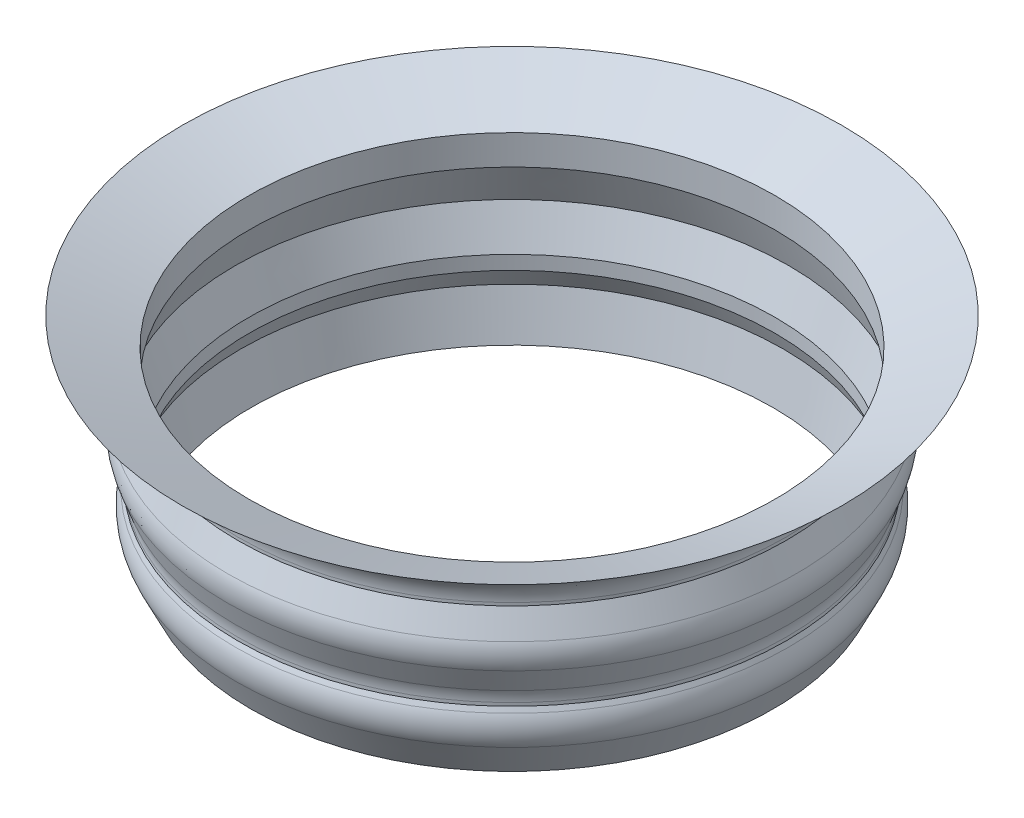
ISO-10303-21;
HEADER;
FILE_DESCRIPTION(('STEP AP214'),'2;1');
FILE_NAME('part.step','',(''),(''),'','','');
FILE_SCHEMA(('AUTOMOTIVE_DESIGN { 1 0 10303 214 1 1 1 1 }'));
ENDSEC;
DATA;
#1=APPLICATION_CONTEXT('core data for automotive mechanical design processes');
#2=APPLICATION_PROTOCOL_DEFINITION('international standard','automotive_design',2000,#1);
#3=PRODUCT_CONTEXT('',#1,'mechanical');
#4=PRODUCT('Part','Part','',(#3));
#5=PRODUCT_RELATED_PRODUCT_CATEGORY('part','',(#4));
#6=PRODUCT_DEFINITION_FORMATION('','',#4);
#7=PRODUCT_DEFINITION_CONTEXT('part definition',#1,'design');
#8=PRODUCT_DEFINITION('design','',#6,#7);
#9=PRODUCT_DEFINITION_SHAPE('','',#8);
#10=(LENGTH_UNIT() NAMED_UNIT(*) SI_UNIT(.MILLI.,.METRE.));
#11=(NAMED_UNIT(*) PLANE_ANGLE_UNIT() SI_UNIT($,.RADIAN.));
#12=(NAMED_UNIT(*) SI_UNIT($,.STERADIAN.) SOLID_ANGLE_UNIT());
#13=UNCERTAINTY_MEASURE_WITH_UNIT(LENGTH_MEASURE(1.E-05),#10,'distance_accuracy_value','');
#14=(GEOMETRIC_REPRESENTATION_CONTEXT(3) GLOBAL_UNCERTAINTY_ASSIGNED_CONTEXT((#13)) GLOBAL_UNIT_ASSIGNED_CONTEXT((#10,
#11,#12)) REPRESENTATION_CONTEXT('',''));
#15=CARTESIAN_POINT('',(0.,0.,0.));
#16=DIRECTION('',(0.,0.,1.));
#17=DIRECTION('',(1.,0.,0.));
#18=AXIS2_PLACEMENT_3D('',#15,#16,#17);
#19=CARTESIAN_POINT('',(0.,72.7332814744845,0.));
#20=DIRECTION('',(0.,1.,0.));
#21=DIRECTION('',(0.,0.,1.));
#22=AXIS2_PLACEMENT_3D('',#19,#20,#21);
#23=CONICAL_SURFACE('',#22,73.025,0.996140422147718);
#24=CARTESIAN_POINT('',(0.,67.0741380629393,0.));
#25=DIRECTION('',(0.,1.,0.));
#26=DIRECTION('',(0.,0.,1.));
#27=AXIS2_PLACEMENT_3D('',#24,#25,#26);
#28=CIRCLE('',#27,64.2857795080226);
#29=CARTESIAN_POINT('',(0.,67.0741380629393,64.2857795080226));
#30=VERTEX_POINT('',#29);
#31=EDGE_CURVE('E48',#30,#30,#28,.T.);
#32=ORIENTED_EDGE('',*,*,#31,.T.);
#33=EDGE_LOOP('',(#32));
#34=FACE_BOUND('',#33,.T.);
#35=CARTESIAN_POINT('',(0.,72.7332814744845,0.));
#36=DIRECTION('',(0.,-1.,0.));
#37=DIRECTION('',(0.,0.,-1.));
#38=AXIS2_PLACEMENT_3D('',#35,#36,#37);
#39=CIRCLE('',#38,73.025);
#40=CARTESIAN_POINT('',(0.,72.7332814744845,-73.025));
#41=VERTEX_POINT('',#40);
#42=EDGE_CURVE('E65',#41,#41,#39,.T.);
#43=ORIENTED_EDGE('',*,*,#42,.T.);
#44=EDGE_LOOP('',(#43));
#45=FACE_BOUND('',#44,.T.);
#46=ADVANCED_FACE('F33',(#34,#45),#23,.T.);
#47=CARTESIAN_POINT('',(0.,66.6316844672459,0.));
#48=DIRECTION('',(0.,1.,0.));
#49=DIRECTION('',(0.,0.,1.));
#50=AXIS2_PLACEMENT_3D('',#47,#48,#49);
#51=CONICAL_SURFACE('',#50,58.2676,1.17874048306246);
#52=ORIENTED_EDGE('',*,*,#42,.F.);
#53=EDGE_LOOP('',(#52));
#54=FACE_BOUND('',#53,.T.);
#55=CARTESIAN_POINT('',(0.,66.6316844672459,0.));
#56=DIRECTION('',(0.,-1.,0.));
#57=DIRECTION('',(0.,0.,-1.));
#58=AXIS2_PLACEMENT_3D('',#55,#56,#57);
#59=CIRCLE('',#58,58.2676);
#60=CARTESIAN_POINT('',(0.,66.6316844672459,-58.2676));
#61=VERTEX_POINT('',#60);
#62=EDGE_CURVE('E68',#61,#61,#59,.T.);
#63=ORIENTED_EDGE('',*,*,#62,.T.);
#64=EDGE_LOOP('',(#63));
#65=FACE_BOUND('',#64,.T.);
#66=ADVANCED_FACE('F113',(#54,#65),#51,.F.);
#67=CARTESIAN_POINT('',(0.,0.,0.));
#68=DIRECTION('',(0.,-1.,0.));
#69=DIRECTION('',(0.,0.,-1.));
#70=AXIS2_PLACEMENT_3D('',#67,#68,#69);
#71=CYLINDRICAL_SURFACE('',#70,58.2676);
#72=ORIENTED_EDGE('',*,*,#62,.F.);
#73=EDGE_LOOP('',(#72));
#74=FACE_BOUND('',#73,.T.);
#75=CARTESIAN_POINT('',(0.,60.0255926489821,0.));
#76=DIRECTION('',(0.,-1.,0.));
#77=DIRECTION('',(0.,0.,-1.));
#78=AXIS2_PLACEMENT_3D('',#75,#76,#77);
#79=CIRCLE('',#78,58.2676);
#80=CARTESIAN_POINT('',(0.,60.0255926489821,-58.2676));
#81=VERTEX_POINT('',#80);
#82=EDGE_CURVE('E71',#81,#81,#79,.T.);
#83=ORIENTED_EDGE('',*,*,#82,.T.);
#84=EDGE_LOOP('',(#83));
#85=FACE_BOUND('',#84,.T.);
#86=ADVANCED_FACE('F119',(#74,#85),#71,.F.);
#87=CARTESIAN_POINT('',(0.,51.6512814744845,0.));
#88=DIRECTION('',(0.,-1.,0.));
#89=DIRECTION('',(0.,0.,-1.));
#90=AXIS2_PLACEMENT_3D('',#87,#88,#89);
#91=CONICAL_SURFACE('',#90,61.3156,0.349065850398867);
#92=ORIENTED_EDGE('',*,*,#82,.F.);
#93=EDGE_LOOP('',(#92));
#94=FACE_BOUND('',#93,.T.);
#95=CARTESIAN_POINT('',(0.,51.6512814744845,0.));
#96=DIRECTION('',(0.,-1.,0.));
#97=DIRECTION('',(0.,0.,-1.));
#98=AXIS2_PLACEMENT_3D('',#95,#96,#97);
#99=CIRCLE('',#98,61.3156);
#100=CARTESIAN_POINT('',(0.,51.6512814744845,-61.3156));
#101=VERTEX_POINT('',#100);
#102=EDGE_CURVE('E74',#101,#101,#99,.T.);
#103=ORIENTED_EDGE('',*,*,#102,.T.);
#104=EDGE_LOOP('',(#103));
#105=FACE_BOUND('',#104,.T.);
#106=ADVANCED_FACE('F164',(#94,#105),#91,.F.);
#107=CARTESIAN_POINT('',(0.,43.2769702999868,0.));
#108=DIRECTION('',(0.,1.,0.));
#109=DIRECTION('',(0.,0.,1.));
#110=AXIS2_PLACEMENT_3D('',#107,#108,#109);
#111=CONICAL_SURFACE('',#110,58.2676,0.349065850398866);
#112=ORIENTED_EDGE('',*,*,#102,.F.);
#113=EDGE_LOOP('',(#112));
#114=FACE_BOUND('',#113,.T.);
#115=CARTESIAN_POINT('',(0.,43.2769702999868,0.));
#116=DIRECTION('',(0.,-1.,0.));
#117=DIRECTION('',(0.,0.,-1.));
#118=AXIS2_PLACEMENT_3D('',#115,#116,#117);
#119=CIRCLE('',#118,58.2676);
#120=CARTESIAN_POINT('',(0.,43.2769702999868,-58.2676));
#121=VERTEX_POINT('',#120);
#122=EDGE_CURVE('E77',#121,#121,#119,.T.);
#123=ORIENTED_EDGE('',*,*,#122,.T.);
#124=EDGE_LOOP('',(#123));
#125=FACE_BOUND('',#124,.T.);
#126=ADVANCED_FACE('F160',(#114,#125),#111,.F.);
#127=CARTESIAN_POINT('',(0.,0.,0.));
#128=DIRECTION('',(0.,-1.,0.));
#129=DIRECTION('',(0.,0.,-1.));
#130=AXIS2_PLACEMENT_3D('',#127,#128,#129);
#131=CYLINDRICAL_SURFACE('',#130,58.2676);
#132=ORIENTED_EDGE('',*,*,#122,.F.);
#133=EDGE_LOOP('',(#132));
#134=FACE_BOUND('',#133,.T.);
#135=CARTESIAN_POINT('',(0.,40.2035702999868,0.));
#136=DIRECTION('',(0.,-1.,0.));
#137=DIRECTION('',(0.,0.,-1.));
#138=AXIS2_PLACEMENT_3D('',#135,#136,#137);
#139=CIRCLE('',#138,58.2676);
#140=CARTESIAN_POINT('',(0.,40.2035702999868,-58.2676));
#141=VERTEX_POINT('',#140);
#142=EDGE_CURVE('E80',#141,#141,#139,.T.);
#143=ORIENTED_EDGE('',*,*,#142,.T.);
#144=EDGE_LOOP('',(#143));
#145=FACE_BOUND('',#144,.T.);
#146=ADVANCED_FACE('F152',(#134,#145),#131,.F.);
#147=CARTESIAN_POINT('',(0.,36.2393838368873,0.));
#148=DIRECTION('',(0.,-1.,0.));
#149=DIRECTION('',(0.,0.,-1.));
#150=AXIS2_PLACEMENT_3D('',#147,#148,#149);
#151=CONICAL_SURFACE('',#150,60.1289792599799,0.438991314074099);
#152=ORIENTED_EDGE('',*,*,#142,.F.);
#153=EDGE_LOOP('',(#152));
#154=FACE_BOUND('',#153,.T.);
#155=CARTESIAN_POINT('',(0.,36.2393838368873,0.));
#156=DIRECTION('',(0.,-1.,0.));
#157=DIRECTION('',(0.,0.,-1.));
#158=AXIS2_PLACEMENT_3D('',#155,#156,#157);
#159=CIRCLE('',#158,60.1289792599799);
#160=CARTESIAN_POINT('',(0.,36.2393838368873,-60.1289792599799));
#161=VERTEX_POINT('',#160);
#162=EDGE_CURVE('E83',#161,#161,#159,.T.);
#163=ORIENTED_EDGE('',*,*,#162,.T.);
#164=EDGE_LOOP('',(#163));
#165=FACE_BOUND('',#164,.T.);
#166=ADVANCED_FACE('F146',(#154,#165),#151,.F.);
#167=CARTESIAN_POINT('',(0.,26.163828165302,0.));
#168=DIRECTION('',(0.,1.,0.));
#169=DIRECTION('',(0.,0.,1.));
#170=AXIS2_PLACEMENT_3D('',#167,#168,#169);
#171=CONICAL_SURFACE('',#170,57.8313234477453,0.224208529564345);
#172=ORIENTED_EDGE('',*,*,#162,.F.);
#173=EDGE_LOOP('',(#172));
#174=FACE_BOUND('',#173,.T.);
#175=CARTESIAN_POINT('',(0.,26.163828165302,0.));
#176=DIRECTION('',(0.,-1.,0.));
#177=DIRECTION('',(0.,0.,-1.));
#178=AXIS2_PLACEMENT_3D('',#175,#176,#177);
#179=CIRCLE('',#178,57.8313234477453);
#180=CARTESIAN_POINT('',(0.,26.163828165302,-57.8313234477453));
#181=VERTEX_POINT('',#180);
#182=EDGE_CURVE('E86',#181,#181,#179,.T.);
#183=ORIENTED_EDGE('',*,*,#182,.T.);
#184=EDGE_LOOP('',(#183));
#185=FACE_BOUND('',#184,.T.);
#186=ADVANCED_FACE('F141',(#174,#185),#171,.F.);
#187=CARTESIAN_POINT('',(0.,36.4652582564435,0.));
#188=DIRECTION('',(0.,1.,0.));
#189=DIRECTION('',(0.,0.,1.));
#190=AXIS2_PLACEMENT_3D('',#187,#188,#189);
#191=CONICAL_SURFACE('',#190,62.828989292589,0.451691455621674);
#192=CARTESIAN_POINT('',(0.,33.1928366686193,0.));
#193=DIRECTION('',(0.,-1.,0.));
#194=DIRECTION('',(0.,0.,-1.));
#195=AXIS2_PLACEMENT_3D('',#192,#193,#194);
#196=CIRCLE('',#195,61.2413971374511);
#197=CARTESIAN_POINT('',(0.,33.1928366686193,-61.2413971374511));
#198=VERTEX_POINT('',#197);
#199=EDGE_CURVE('E44',#198,#198,#196,.T.);
#200=ORIENTED_EDGE('',*,*,#199,.T.);
#201=EDGE_LOOP('',(#200));
#202=FACE_BOUND('',#201,.T.);
#203=ORIENTED_EDGE('',*,*,#182,.F.);
#204=EDGE_LOOP('',(#203));
#205=FACE_BOUND('',#204,.T.);
#206=ADVANCED_FACE('F137',(#202,#205),#191,.T.);
#207=CARTESIAN_POINT('',(0.,40.770218692299,0.));
#208=DIRECTION('',(0.,-1.,0.));
#209=DIRECTION('',(0.,0.,-1.));
#210=AXIS2_PLACEMENT_3D('',#207,#208,#209);
#211=CONICAL_SURFACE('',#210,60.8076,0.4389913140741);
#212=CARTESIAN_POINT('',(0.,39.7575780405701,0.));
#213=DIRECTION('',(0.,1.,0.));
#214=DIRECTION('',(0.,0.,1.));
#215=AXIS2_PLACEMENT_3D('',#212,#213,#214);
#216=CIRCLE('',#215,61.2830842700984);
#217=CARTESIAN_POINT('',(0.,39.7575780405701,61.2830842700984));
#218=VERTEX_POINT('',#217);
#219=EDGE_CURVE('E40',#218,#218,#216,.T.);
#220=ORIENTED_EDGE('',*,*,#219,.T.);
#221=EDGE_LOOP('',(#220));
#222=FACE_BOUND('',#221,.T.);
#223=CARTESIAN_POINT('',(0.,40.770218692299,0.));
#224=DIRECTION('',(0.,-1.,0.));
#225=DIRECTION('',(0.,0.,-1.));
#226=AXIS2_PLACEMENT_3D('',#223,#224,#225);
#227=CIRCLE('',#226,60.8076);
#228=CARTESIAN_POINT('',(0.,40.770218692299,-60.8076));
#229=VERTEX_POINT('',#228);
#230=EDGE_CURVE('E89',#229,#229,#227,.T.);
#231=ORIENTED_EDGE('',*,*,#230,.T.);
#232=EDGE_LOOP('',(#231));
#233=FACE_BOUND('',#232,.T.);
#234=ADVANCED_FACE('F140',(#222,#233),#211,.T.);
#235=CARTESIAN_POINT('',(0.,0.,0.));
#236=DIRECTION('',(0.,-1.,0.));
#237=DIRECTION('',(0.,0.,-1.));
#238=AXIS2_PLACEMENT_3D('',#235,#236,#237);
#239=CYLINDRICAL_SURFACE('',#238,60.8076);
#240=CARTESIAN_POINT('',(0.,41.4854881759888,0.));
#241=DIRECTION('',(0.,-1.,0.));
#242=DIRECTION('',(0.,0.,-1.));
#243=AXIS2_PLACEMENT_3D('',#240,#241,#242);
#244=CIRCLE('',#243,60.8076);
#245=CARTESIAN_POINT('',(0.,41.4854881759888,-60.8076));
#246=VERTEX_POINT('',#245);
#247=EDGE_CURVE('E62',#246,#246,#244,.T.);
#248=ORIENTED_EDGE('',*,*,#247,.T.);
#249=EDGE_LOOP('',(#248));
#250=FACE_BOUND('',#249,.T.);
#251=ORIENTED_EDGE('',*,*,#230,.F.);
#252=EDGE_LOOP('',(#251));
#253=FACE_BOUND('',#252,.T.);
#254=ADVANCED_FACE('F225',(#250,#253),#239,.T.);
#255=CARTESIAN_POINT('',(0.,51.9789520060735,0.));
#256=DIRECTION('',(0.,1.,0.));
#257=DIRECTION('',(0.,0.,1.));
#258=AXIS2_PLACEMENT_3D('',#255,#256,#257);
#259=CONICAL_SURFACE('',#258,64.1378738622334,0.349065850398866);
#260=CARTESIAN_POINT('',(0.,44.0916816681304,0.));
#261=DIRECTION('',(0.,1.,0.));
#262=DIRECTION('',(0.,0.,1.));
#263=AXIS2_PLACEMENT_3D('',#260,#261,#262);
#264=CIRCLE('',#263,61.2671422296114);
#265=CARTESIAN_POINT('',(0.,44.0916816681304,61.2671422296114));
#266=VERTEX_POINT('',#265);
#267=EDGE_CURVE('E56',#266,#266,#264,.T.);
#268=ORIENTED_EDGE('',*,*,#267,.T.);
#269=EDGE_LOOP('',(#268));
#270=FACE_BOUND('',#269,.T.);
#271=CARTESIAN_POINT('',(0.,49.1956063387652,0.));
#272=DIRECTION('',(0.,-1.,0.));
#273=DIRECTION('',(0.,0.,-1.));
#274=AXIS2_PLACEMENT_3D('',#271,#272,#273);
#275=CIRCLE('',#274,63.1248188876594);
#276=CARTESIAN_POINT('',(0.,49.1956063387652,-63.1248188876594));
#277=VERTEX_POINT('',#276);
#278=EDGE_CURVE('E59',#277,#277,#275,.T.);
#279=ORIENTED_EDGE('',*,*,#278,.T.);
#280=EDGE_LOOP('',(#279));
#281=FACE_BOUND('',#280,.T.);
#282=ADVANCED_FACE('F110',(#270,#281),#259,.T.);
#283=CARTESIAN_POINT('',(0.,60.0255926489821,0.));
#284=DIRECTION('',(0.,-1.,0.));
#285=DIRECTION('',(0.,0.,-1.));
#286=AXIS2_PLACEMENT_3D('',#283,#284,#285);
#287=CONICAL_SURFACE('',#286,60.8076,0.392406932471071);
#288=CARTESIAN_POINT('',(0.,54.715790741642,0.));
#289=DIRECTION('',(0.,1.,0.));
#290=DIRECTION('',(0.,0.,1.));
#291=AXIS2_PLACEMENT_3D('',#288,#289,#290);
#292=CIRCLE('',#291,63.0051747756595);
#293=CARTESIAN_POINT('',(0.,54.715790741642,63.0051747756595));
#294=VERTEX_POINT('',#293);
#295=EDGE_CURVE('E10',#294,#294,#292,.T.);
#296=ORIENTED_EDGE('',*,*,#295,.T.);
#297=EDGE_LOOP('',(#296));
#298=FACE_BOUND('',#297,.T.);
#299=CARTESIAN_POINT('',(0.,60.0255926489821,0.));
#300=DIRECTION('',(0.,-1.,0.));
#301=DIRECTION('',(0.,0.,-1.));
#302=AXIS2_PLACEMENT_3D('',#299,#300,#301);
#303=CIRCLE('',#302,60.8076);
#304=CARTESIAN_POINT('',(0.,60.0255926489821,-60.8076));
#305=VERTEX_POINT('',#304);
#306=EDGE_CURVE('E92',#305,#305,#303,.T.);
#307=ORIENTED_EDGE('',*,*,#306,.T.);
#308=EDGE_LOOP('',(#307));
#309=FACE_BOUND('',#308,.T.);
#310=ADVANCED_FACE('F96',(#298,#309),#287,.T.);
#311=CARTESIAN_POINT('',(0.,0.,0.));
#312=DIRECTION('',(0.,-1.,0.));
#313=DIRECTION('',(0.,0.,-1.));
#314=AXIS2_PLACEMENT_3D('',#311,#312,#313);
#315=CYLINDRICAL_SURFACE('',#314,60.8076);
#316=CARTESIAN_POINT('',(0.,60.6780671586859,0.));
#317=DIRECTION('',(0.,-1.,0.));
#318=DIRECTION('',(0.,0.,-1.));
#319=AXIS2_PLACEMENT_3D('',#316,#317,#318);
#320=CIRCLE('',#319,60.8076);
#321=CARTESIAN_POINT('',(0.,60.6780671586859,-60.8076));
#322=VERTEX_POINT('',#321);
#323=EDGE_CURVE('E53',#322,#322,#320,.T.);
#324=ORIENTED_EDGE('',*,*,#323,.T.);
#325=EDGE_LOOP('',(#324));
#326=FACE_BOUND('',#325,.T.);
#327=ORIENTED_EDGE('',*,*,#306,.F.);
#328=EDGE_LOOP('',(#327));
#329=FACE_BOUND('',#328,.T.);
#330=ADVANCED_FACE('F98',(#326,#329),#315,.T.);
#331=CARTESIAN_POINT('',(0.,41.4854881759888,0.));
#332=DIRECTION('',(0.,-1.,0.));
#333=DIRECTION('',(0.,0.,-1.));
#334=AXIS2_PLACEMENT_3D('',#331,#332,#333);
#335=TOROIDAL_SURFACE('',#334,68.4276,7.62);
#336=ORIENTED_EDGE('',*,*,#267,.F.);
#337=EDGE_LOOP('',(#336));
#338=FACE_BOUND('',#337,.T.);
#339=ORIENTED_EDGE('',*,*,#247,.F.);
#340=EDGE_LOOP('',(#339));
#341=FACE_BOUND('',#340,.T.);
#342=ADVANCED_FACE('F100',(#338,#341),#335,.F.);
#343=CARTESIAN_POINT('',(0.,60.6780671586859,0.));
#344=DIRECTION('',(0.,-1.,0.));
#345=DIRECTION('',(0.,0.,-1.));
#346=AXIS2_PLACEMENT_3D('',#343,#344,#345);
#347=TOROIDAL_SURFACE('',#346,68.4276,7.62);
#348=ORIENTED_EDGE('',*,*,#31,.F.);
#349=EDGE_LOOP('',(#348));
#350=FACE_BOUND('',#349,.T.);
#351=ORIENTED_EDGE('',*,*,#323,.F.);
#352=EDGE_LOOP('',(#351));
#353=FACE_BOUND('',#352,.T.);
#354=ADVANCED_FACE('F107',(#350,#353),#347,.F.);
#355=CARTESIAN_POINT('',(0.,36.5188750569819,0.));
#356=DIRECTION('',(0.,1.,0.));
#357=DIRECTION('',(0.,0.,1.));
#358=AXIS2_PLACEMENT_3D('',#355,#356,#357);
#359=TOROIDAL_SURFACE('',#358,54.3856062538886,7.62);
#360=ORIENTED_EDGE('',*,*,#219,.F.);
#361=EDGE_LOOP('',(#360));
#362=FACE_BOUND('',#361,.T.);
#363=ORIENTED_EDGE('',*,*,#199,.F.);
#364=EDGE_LOOP('',(#363));
#365=FACE_BOUND('',#364,.T.);
#366=ADVANCED_FACE('F126',(#362,#365),#359,.T.);
#367=CARTESIAN_POINT('',(0.,51.8017998309068,0.));
#368=DIRECTION('',(0.,1.,0.));
#369=DIRECTION('',(0.,0.,1.));
#370=AXIS2_PLACEMENT_3D('',#367,#368,#369);
#371=TOROIDAL_SURFACE('',#370,55.9643611172708,7.62);
#372=ORIENTED_EDGE('',*,*,#295,.F.);
#373=EDGE_LOOP('',(#372));
#374=FACE_BOUND('',#373,.T.);
#375=ORIENTED_EDGE('',*,*,#278,.F.);
#376=EDGE_LOOP('',(#375));
#377=FACE_BOUND('',#376,.T.);
#378=ADVANCED_FACE('F35',(#374,#377),#371,.T.);
#379=CLOSED_SHELL('',(#46,#66,#86,#106,#126,#146,#166,#186,#206,#234,#254,#282,#310,#330,#342,
#354,#366,#378));
#380=MANIFOLD_SOLID_BREP('B2',#379);
#381=ADVANCED_BREP_SHAPE_REPRESENTATION('',(#18,#380),#14);
#382=SHAPE_DEFINITION_REPRESENTATION(#9,#381);
ENDSEC;
END-ISO-10303-21;
